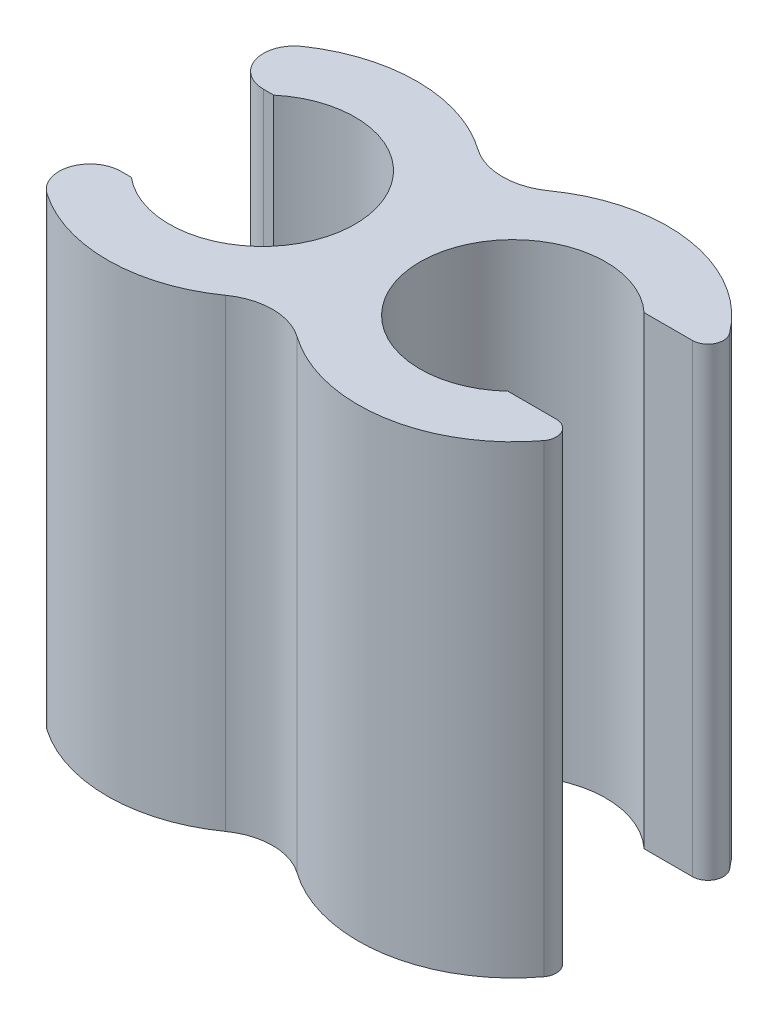
ISO-10303-21;
HEADER;
FILE_DESCRIPTION(('STEP AP214'),'2;1');
FILE_NAME('part.step','',(''),(''),'','','');
FILE_SCHEMA(('AUTOMOTIVE_DESIGN { 1 0 10303 214 1 1 1 1 }'));
ENDSEC;
DATA;
#1=APPLICATION_CONTEXT('core data for automotive mechanical design processes');
#2=APPLICATION_PROTOCOL_DEFINITION('international standard','automotive_design',2000,#1);
#3=PRODUCT_CONTEXT('',#1,'mechanical');
#4=PRODUCT('Part','Part','',(#3));
#5=PRODUCT_RELATED_PRODUCT_CATEGORY('part','',(#4));
#6=PRODUCT_DEFINITION_FORMATION('','',#4);
#7=PRODUCT_DEFINITION_CONTEXT('part definition',#1,'design');
#8=PRODUCT_DEFINITION('design','',#6,#7);
#9=PRODUCT_DEFINITION_SHAPE('','',#8);
#10=(LENGTH_UNIT() NAMED_UNIT(*) SI_UNIT(.MILLI.,.METRE.));
#11=(NAMED_UNIT(*) PLANE_ANGLE_UNIT() SI_UNIT($,.RADIAN.));
#12=(NAMED_UNIT(*) SI_UNIT($,.STERADIAN.) SOLID_ANGLE_UNIT());
#13=UNCERTAINTY_MEASURE_WITH_UNIT(LENGTH_MEASURE(1.E-05),#10,'distance_accuracy_value','');
#14=(GEOMETRIC_REPRESENTATION_CONTEXT(3) GLOBAL_UNCERTAINTY_ASSIGNED_CONTEXT((#13)) GLOBAL_UNIT_ASSIGNED_CONTEXT((#10,
#11,#12)) REPRESENTATION_CONTEXT('',''));
#15=CARTESIAN_POINT('',(0.,0.,0.));
#16=DIRECTION('',(0.,0.,1.));
#17=DIRECTION('',(1.,0.,0.));
#18=AXIS2_PLACEMENT_3D('',#15,#16,#17);
#19=CARTESIAN_POINT('',(8.10004414496258,0.,0.00233525388321351));
#20=DIRECTION('',(0.,1.,0.));
#21=DIRECTION('',(0.,0.,1.));
#22=AXIS2_PLACEMENT_3D('',#19,#20,#21);
#23=CYLINDRICAL_SURFACE('',#22,5.);
#24=CARTESIAN_POINT('',(8.10004414496258,15.,0.00233525388321351));
#25=DIRECTION('',(0.,1.,0.));
#26=DIRECTION('',(0.,0.,1.));
#27=AXIS2_PLACEMENT_3D('',#24,#25,#26);
#28=CIRCLE('',#27,5.);
#29=CARTESIAN_POINT('',(12.1000441449626,15.,-2.99766474611679));
#30=VERTEX_POINT('',#29);
#31=CARTESIAN_POINT('',(5.20834697149032,15.,-4.07664592490795));
#32=VERTEX_POINT('',#31);
#33=EDGE_CURVE('E174',#30,#32,#28,.T.);
#34=ORIENTED_EDGE('',*,*,#33,.F.);
#35=DIRECTION('',(0.,1.,0.));
#36=VECTOR('',#35,1.);
#37=CARTESIAN_POINT('',(12.1000441449626,0.,-2.99766474611679));
#38=LINE('',#37,#36);
#39=CARTESIAN_POINT('',(12.1000441449626,0.,-2.99766474611679));
#40=VERTEX_POINT('',#39);
#41=EDGE_CURVE('E11',#30,#40,#38,.F.);
#42=ORIENTED_EDGE('',*,*,#41,.T.);
#43=CARTESIAN_POINT('',(8.10004414496258,0.,0.00233525388321351));
#44=DIRECTION('',(0.,1.,0.));
#45=DIRECTION('',(0.,0.,1.));
#46=AXIS2_PLACEMENT_3D('',#43,#44,#45);
#47=CIRCLE('',#46,5.);
#48=CARTESIAN_POINT('',(5.20834697149032,0.,-4.07664592490795));
#49=VERTEX_POINT('',#48);
#50=EDGE_CURVE('E185',#40,#49,#47,.T.);
#51=ORIENTED_EDGE('',*,*,#50,.T.);
#52=DIRECTION('',(0.,1.,0.));
#53=VECTOR('',#52,1.);
#54=CARTESIAN_POINT('',(5.20834697149032,0.,-4.07664592490795));
#55=LINE('',#54,#53);
#56=EDGE_CURVE('E209',#49,#32,#55,.T.);
#57=ORIENTED_EDGE('',*,*,#56,.T.);
#58=EDGE_LOOP('',(#34,#42,#51,#57));
#59=FACE_BOUND('',#58,.T.);
#60=ADVANCED_FACE('F33',(#59),#23,.T.);
#61=CARTESIAN_POINT('',(0.,15.,0.));
#62=DIRECTION('',(0.,-1.,0.));
#63=DIRECTION('',(0.,0.,-1.));
#64=AXIS2_PLACEMENT_3D('',#61,#62,#63);
#65=CYLINDRICAL_SURFACE('',#64,5.);
#66=CARTESIAN_POINT('',(0.,15.,0.));
#67=DIRECTION('',(0.,1.,0.));
#68=DIRECTION('',(0.,0.,1.));
#69=AXIS2_PLACEMENT_3D('',#66,#67,#68);
#70=CIRCLE('',#69,5.);
#71=CARTESIAN_POINT('',(-2.82566363886433,15.,4.125));
#72=VERTEX_POINT('',#71);
#73=CARTESIAN_POINT('',(2.89169717347226,15.,4.07898117879116));
#74=VERTEX_POINT('',#73);
#75=EDGE_CURVE('E198',#72,#74,#70,.T.);
#76=ORIENTED_EDGE('',*,*,#75,.F.);
#77=DIRECTION('',(0.,-1.,0.));
#78=VECTOR('',#77,1.);
#79=CARTESIAN_POINT('',(-2.82566363886433,15.,4.125));
#80=LINE('',#79,#78);
#81=CARTESIAN_POINT('',(-2.82566363886433,0.,4.125));
#82=VERTEX_POINT('',#81);
#83=EDGE_CURVE('E227',#72,#82,#80,.T.);
#84=ORIENTED_EDGE('',*,*,#83,.T.);
#85=CARTESIAN_POINT('',(0.,0.,0.));
#86=DIRECTION('',(0.,1.,0.));
#87=DIRECTION('',(0.,0.,1.));
#88=AXIS2_PLACEMENT_3D('',#85,#86,#87);
#89=CIRCLE('',#88,5.);
#90=CARTESIAN_POINT('',(2.89169717347226,0.,4.07898117879116));
#91=VERTEX_POINT('',#90);
#92=EDGE_CURVE('E191',#82,#91,#89,.T.);
#93=ORIENTED_EDGE('',*,*,#92,.T.);
#94=DIRECTION('',(0.,-1.,0.));
#95=VECTOR('',#94,1.);
#96=CARTESIAN_POINT('',(2.89169717347226,15.,4.07898117879116));
#97=LINE('',#96,#95);
#98=EDGE_CURVE('E197',#91,#74,#97,.F.);
#99=ORIENTED_EDGE('',*,*,#98,.T.);
#100=EDGE_LOOP('',(#76,#84,#93,#99));
#101=FACE_BOUND('',#100,.T.);
#102=ADVANCED_FACE('F282',(#101),#65,.T.);
#103=CARTESIAN_POINT('',(0.,15.,0.));
#104=DIRECTION('',(0.,1.,0.));
#105=DIRECTION('',(0.,0.,1.));
#106=AXIS2_PLACEMENT_3D('',#103,#104,#105);
#107=PLANE('',#106);
#108=CARTESIAN_POINT('',(5.20599550060443,15.,4.07964839418636));
#109=VERTEX_POINT('',#108);
#110=CARTESIAN_POINT('',(12.1000441449626,15.,3.00233525388321));
#111=VERTEX_POINT('',#110);
#112=EDGE_CURVE('E186',#109,#111,#28,.T.);
#113=ORIENTED_EDGE('',*,*,#112,.T.);
#114=CARTESIAN_POINT('',(11.7000441449626,15.,2.70233525388321));
#115=DIRECTION('',(0.,1.,0.));
#116=DIRECTION('',(0.,0.,1.));
#117=AXIS2_PLACEMENT_3D('',#114,#115,#116);
#118=CIRCLE('',#117,0.5);
#119=CARTESIAN_POINT('',(11.7000441449626,15.,2.20233525388321));
#120=VERTEX_POINT('',#119);
#121=EDGE_CURVE('E165',#111,#120,#118,.T.);
#122=ORIENTED_EDGE('',*,*,#121,.T.);
#123=DIRECTION('',(1.,0.,0.));
#124=VECTOR('',#123,1.);
#125=CARTESIAN_POINT('',(8.52364594933811,15.,2.20233525388321));
#126=LINE('',#125,#124);
#127=CARTESIAN_POINT('',(10.1396519503997,15.,2.20233525388321));
#128=VERTEX_POINT('',#127);
#129=EDGE_CURVE('E149',#128,#120,#126,.T.);
#130=ORIENTED_EDGE('',*,*,#129,.F.);
#131=CARTESIAN_POINT('',(8.10004414496258,15.,0.00233525388321351));
#132=DIRECTION('',(0.,1.,0.));
#133=DIRECTION('',(0.,0.,1.));
#134=AXIS2_PLACEMENT_3D('',#131,#132,#133);
#135=CIRCLE('',#134,3.);
#136=CARTESIAN_POINT('',(10.1396519503997,15.,-2.19766474611679));
#137=VERTEX_POINT('',#136);
#138=EDGE_CURVE('E163',#137,#128,#135,.T.);
#139=ORIENTED_EDGE('',*,*,#138,.F.);
#140=DIRECTION('',(-1.,0.,0.));
#141=VECTOR('',#140,1.);
#142=CARTESIAN_POINT('',(8.52364594933811,15.,-2.19766474611679));
#143=LINE('',#142,#141);
#144=CARTESIAN_POINT('',(11.7000441449626,15.,-2.19766474611679));
#145=VERTEX_POINT('',#144);
#146=EDGE_CURVE('E166',#145,#137,#143,.T.);
#147=ORIENTED_EDGE('',*,*,#146,.F.);
#148=CARTESIAN_POINT('',(11.7000441449626,15.,-2.69766474611679));
#149=DIRECTION('',(0.,1.,0.));
#150=DIRECTION('',(0.,0.,1.));
#151=AXIS2_PLACEMENT_3D('',#148,#149,#150);
#152=CIRCLE('',#151,0.5);
#153=EDGE_CURVE('E48',#145,#30,#152,.T.);
#154=ORIENTED_EDGE('',*,*,#153,.T.);
#155=ORIENTED_EDGE('',*,*,#33,.T.);
#156=CARTESIAN_POINT('',(4.05166810210141,15.,-5.70823839642441));
#157=DIRECTION('',(0.,1.,0.));
#158=DIRECTION('',(0.,0.,1.));
#159=AXIS2_PLACEMENT_3D('',#156,#157,#158);
#160=CIRCLE('',#159,2.);
#161=CARTESIAN_POINT('',(2.89404864435815,15.,-4.07731314030315));
#162=VERTEX_POINT('',#161);
#163=EDGE_CURVE('E215',#32,#162,#160,.F.);
#164=ORIENTED_EDGE('',*,*,#163,.T.);
#165=CARTESIAN_POINT('',(-2.82566363886433,15.,-4.125));
#166=VERTEX_POINT('',#165);
#167=EDGE_CURVE('E194',#162,#166,#70,.T.);
#168=ORIENTED_EDGE('',*,*,#167,.T.);
#169=CARTESIAN_POINT('',(-2.26053091109146,15.,-3.3));
#170=DIRECTION('',(0.,1.,0.));
#171=DIRECTION('',(0.,0.,1.));
#172=AXIS2_PLACEMENT_3D('',#169,#170,#171);
#173=CIRCLE('',#172,1.);
#174=CARTESIAN_POINT('',(-2.26053091109146,15.,-2.3));
#175=VERTEX_POINT('',#174);
#176=EDGE_CURVE('E236',#166,#175,#173,.T.);
#177=ORIENTED_EDGE('',*,*,#176,.T.);
#178=DIRECTION('',(1.,0.,0.));
#179=VECTOR('',#178,1.);
#180=CARTESIAN_POINT('',(-7.30921560038474,15.,-2.3));
#181=LINE('',#180,#179);
#182=CARTESIAN_POINT('',(-1.92613602842582,15.,-2.3));
#183=VERTEX_POINT('',#182);
#184=EDGE_CURVE('E177',#175,#183,#181,.T.);
#185=ORIENTED_EDGE('',*,*,#184,.T.);
#186=CARTESIAN_POINT('',(0.,15.,0.));
#187=DIRECTION('',(0.,1.,0.));
#188=DIRECTION('',(0.,0.,1.));
#189=AXIS2_PLACEMENT_3D('',#186,#187,#188);
#190=CIRCLE('',#189,3.);
#191=CARTESIAN_POINT('',(-1.92613602842582,15.,2.3));
#192=VERTEX_POINT('',#191);
#193=EDGE_CURVE('E188',#192,#183,#190,.T.);
#194=ORIENTED_EDGE('',*,*,#193,.F.);
#195=DIRECTION('',(-1.,0.,0.));
#196=VECTOR('',#195,1.);
#197=CARTESIAN_POINT('',(-7.30921560038474,15.,2.3));
#198=LINE('',#197,#196);
#199=CARTESIAN_POINT('',(-2.26053091109146,15.,2.3));
#200=VERTEX_POINT('',#199);
#201=EDGE_CURVE('E172',#192,#200,#198,.T.);
#202=ORIENTED_EDGE('',*,*,#201,.T.);
#203=CARTESIAN_POINT('',(-2.26053091109146,15.,3.3));
#204=DIRECTION('',(0.,1.,0.));
#205=DIRECTION('',(0.,0.,1.));
#206=AXIS2_PLACEMENT_3D('',#203,#204,#205);
#207=CIRCLE('',#206,1.);
#208=EDGE_CURVE('E238',#200,#72,#207,.T.);
#209=ORIENTED_EDGE('',*,*,#208,.T.);
#210=ORIENTED_EDGE('',*,*,#75,.T.);
#211=CARTESIAN_POINT('',(4.04837604286117,15.,5.71057365030763));
#212=DIRECTION('',(0.,1.,0.));
#213=DIRECTION('',(0.,0.,1.));
#214=AXIS2_PLACEMENT_3D('',#211,#212,#213);
#215=CIRCLE('',#214,2.);
#216=EDGE_CURVE('E217',#74,#109,#215,.F.);
#217=ORIENTED_EDGE('',*,*,#216,.T.);
#218=EDGE_LOOP('',(#113,#122,#130,#139,#147,#154,#155,#164,#168,#177,#185,#194,#202,#209,#210,#217));
#219=FACE_BOUND('',#218,.T.);
#220=ADVANCED_FACE('F162',(#219),#107,.T.);
#221=CARTESIAN_POINT('',(0.,0.,0.));
#222=DIRECTION('',(0.,1.,0.));
#223=DIRECTION('',(0.,0.,1.));
#224=AXIS2_PLACEMENT_3D('',#221,#222,#223);
#225=PLANE('',#224);
#226=DIRECTION('',(1.,0.,0.));
#227=VECTOR('',#226,1.);
#228=CARTESIAN_POINT('',(8.52364594933811,0.,2.20233525388321));
#229=LINE('',#228,#227);
#230=CARTESIAN_POINT('',(10.1396519503997,0.,2.20233525388321));
#231=VERTEX_POINT('',#230);
#232=CARTESIAN_POINT('',(11.7000441449626,0.,2.20233525388321));
#233=VERTEX_POINT('',#232);
#234=EDGE_CURVE('E152',#231,#233,#229,.T.);
#235=ORIENTED_EDGE('',*,*,#234,.T.);
#236=CARTESIAN_POINT('',(11.7000441449626,0.,2.70233525388321));
#237=DIRECTION('',(0.,1.,0.));
#238=DIRECTION('',(0.,0.,1.));
#239=AXIS2_PLACEMENT_3D('',#236,#237,#238);
#240=CIRCLE('',#239,0.5);
#241=CARTESIAN_POINT('',(12.1000441449626,0.,3.00233525388321));
#242=VERTEX_POINT('',#241);
#243=EDGE_CURVE('E249',#233,#242,#240,.F.);
#244=ORIENTED_EDGE('',*,*,#243,.T.);
#245=CARTESIAN_POINT('',(5.20599550060443,0.,4.07964839418636));
#246=VERTEX_POINT('',#245);
#247=EDGE_CURVE('E181',#246,#242,#47,.T.);
#248=ORIENTED_EDGE('',*,*,#247,.F.);
#249=CARTESIAN_POINT('',(4.04837604286117,0.,5.71057365030763));
#250=DIRECTION('',(0.,1.,0.));
#251=DIRECTION('',(0.,0.,1.));
#252=AXIS2_PLACEMENT_3D('',#249,#250,#251);
#253=CIRCLE('',#252,2.);
#254=EDGE_CURVE('E219',#246,#91,#253,.T.);
#255=ORIENTED_EDGE('',*,*,#254,.T.);
#256=ORIENTED_EDGE('',*,*,#92,.F.);
#257=CARTESIAN_POINT('',(-2.26053091109146,0.,3.3));
#258=DIRECTION('',(0.,1.,0.));
#259=DIRECTION('',(0.,0.,1.));
#260=AXIS2_PLACEMENT_3D('',#257,#258,#259);
#261=CIRCLE('',#260,1.);
#262=CARTESIAN_POINT('',(-2.26053091109146,0.,2.3));
#263=VERTEX_POINT('',#262);
#264=EDGE_CURVE('E232',#82,#263,#261,.F.);
#265=ORIENTED_EDGE('',*,*,#264,.T.);
#266=DIRECTION('',(-1.,0.,0.));
#267=VECTOR('',#266,1.);
#268=CARTESIAN_POINT('',(-7.30921560038474,0.,2.3));
#269=LINE('',#268,#267);
#270=CARTESIAN_POINT('',(-1.92613602842582,0.,2.3));
#271=VERTEX_POINT('',#270);
#272=EDGE_CURVE('E263',#271,#263,#269,.T.);
#273=ORIENTED_EDGE('',*,*,#272,.F.);
#274=CARTESIAN_POINT('',(0.,0.,0.));
#275=DIRECTION('',(0.,1.,0.));
#276=DIRECTION('',(0.,0.,1.));
#277=AXIS2_PLACEMENT_3D('',#274,#275,#276);
#278=CIRCLE('',#277,3.);
#279=CARTESIAN_POINT('',(-1.92613602842582,0.,-2.3));
#280=VERTEX_POINT('',#279);
#281=EDGE_CURVE('E184',#271,#280,#278,.T.);
#282=ORIENTED_EDGE('',*,*,#281,.T.);
#283=DIRECTION('',(1.,0.,0.));
#284=VECTOR('',#283,1.);
#285=CARTESIAN_POINT('',(-7.30921560038474,0.,-2.3));
#286=LINE('',#285,#284);
#287=CARTESIAN_POINT('',(-2.26053091109146,0.,-2.3));
#288=VERTEX_POINT('',#287);
#289=EDGE_CURVE('E265',#288,#280,#286,.T.);
#290=ORIENTED_EDGE('',*,*,#289,.F.);
#291=CARTESIAN_POINT('',(-2.26053091109146,0.,-3.3));
#292=DIRECTION('',(0.,1.,0.));
#293=DIRECTION('',(0.,0.,1.));
#294=AXIS2_PLACEMENT_3D('',#291,#292,#293);
#295=CIRCLE('',#294,1.);
#296=CARTESIAN_POINT('',(-2.82566363886433,0.,-4.125));
#297=VERTEX_POINT('',#296);
#298=EDGE_CURVE('E230',#288,#297,#295,.F.);
#299=ORIENTED_EDGE('',*,*,#298,.T.);
#300=CARTESIAN_POINT('',(2.89404864435815,0.,-4.07731314030315));
#301=VERTEX_POINT('',#300);
#302=EDGE_CURVE('E199',#301,#297,#89,.T.);
#303=ORIENTED_EDGE('',*,*,#302,.F.);
#304=CARTESIAN_POINT('',(4.05166810210141,0.,-5.70823839642441));
#305=DIRECTION('',(0.,1.,0.));
#306=DIRECTION('',(0.,0.,1.));
#307=AXIS2_PLACEMENT_3D('',#304,#305,#306);
#308=CIRCLE('',#307,2.);
#309=EDGE_CURVE('E212',#301,#49,#308,.T.);
#310=ORIENTED_EDGE('',*,*,#309,.T.);
#311=ORIENTED_EDGE('',*,*,#50,.F.);
#312=CARTESIAN_POINT('',(11.7000441449626,0.,-2.69766474611679));
#313=DIRECTION('',(0.,1.,0.));
#314=DIRECTION('',(0.,0.,1.));
#315=AXIS2_PLACEMENT_3D('',#312,#313,#314);
#316=CIRCLE('',#315,0.5);
#317=CARTESIAN_POINT('',(11.7000441449626,0.,-2.19766474611679));
#318=VERTEX_POINT('',#317);
#319=EDGE_CURVE('E247',#40,#318,#316,.F.);
#320=ORIENTED_EDGE('',*,*,#319,.T.);
#321=DIRECTION('',(-1.,0.,0.));
#322=VECTOR('',#321,1.);
#323=CARTESIAN_POINT('',(8.52364594933811,0.,-2.19766474611679));
#324=LINE('',#323,#322);
#325=CARTESIAN_POINT('',(10.1396519503997,0.,-2.19766474611679));
#326=VERTEX_POINT('',#325);
#327=EDGE_CURVE('E257',#318,#326,#324,.T.);
#328=ORIENTED_EDGE('',*,*,#327,.T.);
#329=CARTESIAN_POINT('',(8.10004414496258,0.,0.00233525388321351));
#330=DIRECTION('',(0.,1.,0.));
#331=DIRECTION('',(0.,0.,1.));
#332=AXIS2_PLACEMENT_3D('',#329,#330,#331);
#333=CIRCLE('',#332,3.);
#334=EDGE_CURVE('E171',#326,#231,#333,.T.);
#335=ORIENTED_EDGE('',*,*,#334,.T.);
#336=EDGE_LOOP('',(#235,#244,#248,#255,#256,#265,#273,#282,#290,#299,#303,#310,#311,#320,#328,#335));
#337=FACE_BOUND('',#336,.T.);
#338=ADVANCED_FACE('F296',(#337),#225,.F.);
#339=ORIENTED_EDGE('',*,*,#302,.T.);
#340=DIRECTION('',(0.,-1.,0.));
#341=VECTOR('',#340,1.);
#342=CARTESIAN_POINT('',(-2.82566363886433,15.,-4.125));
#343=LINE('',#342,#341);
#344=EDGE_CURVE('E240',#297,#166,#343,.F.);
#345=ORIENTED_EDGE('',*,*,#344,.T.);
#346=ORIENTED_EDGE('',*,*,#167,.F.);
#347=DIRECTION('',(0.,-1.,0.));
#348=VECTOR('',#347,1.);
#349=CARTESIAN_POINT('',(2.89404864435815,15.,-4.07731314030315));
#350=LINE('',#349,#348);
#351=EDGE_CURVE('E204',#162,#301,#350,.T.);
#352=ORIENTED_EDGE('',*,*,#351,.T.);
#353=EDGE_LOOP('',(#339,#345,#346,#352));
#354=FACE_BOUND('',#353,.T.);
#355=ADVANCED_FACE('F305',(#354),#65,.T.);
#356=CARTESIAN_POINT('',(0.,15.,0.));
#357=DIRECTION('',(0.,-1.,0.));
#358=DIRECTION('',(0.,0.,-1.));
#359=AXIS2_PLACEMENT_3D('',#356,#357,#358);
#360=CYLINDRICAL_SURFACE('',#359,3.);
#361=DIRECTION('',(0.,-1.,0.));
#362=VECTOR('',#361,1.);
#363=CARTESIAN_POINT('',(-1.92613602842582,15.,2.3));
#364=LINE('',#363,#362);
#365=EDGE_CURVE('E225',#192,#271,#364,.T.);
#366=ORIENTED_EDGE('',*,*,#365,.F.);
#367=ORIENTED_EDGE('',*,*,#193,.T.);
#368=DIRECTION('',(0.,-1.,0.));
#369=VECTOR('',#368,1.);
#370=CARTESIAN_POINT('',(-1.92613602842582,15.,-2.3));
#371=LINE('',#370,#369);
#372=EDGE_CURVE('E222',#280,#183,#371,.F.);
#373=ORIENTED_EDGE('',*,*,#372,.F.);
#374=ORIENTED_EDGE('',*,*,#281,.F.);
#375=EDGE_LOOP('',(#366,#367,#373,#374));
#376=FACE_BOUND('',#375,.T.);
#377=ADVANCED_FACE('F319',(#376),#360,.F.);
#378=ORIENTED_EDGE('',*,*,#247,.T.);
#379=DIRECTION('',(0.,1.,0.));
#380=VECTOR('',#379,1.);
#381=CARTESIAN_POINT('',(12.1000441449626,0.,3.00233525388321));
#382=LINE('',#381,#380);
#383=EDGE_CURVE('E251',#242,#111,#382,.T.);
#384=ORIENTED_EDGE('',*,*,#383,.T.);
#385=ORIENTED_EDGE('',*,*,#112,.F.);
#386=DIRECTION('',(0.,1.,0.));
#387=VECTOR('',#386,1.);
#388=CARTESIAN_POINT('',(5.20599550060443,0.,4.07964839418636));
#389=LINE('',#388,#387);
#390=EDGE_CURVE('E207',#109,#246,#389,.F.);
#391=ORIENTED_EDGE('',*,*,#390,.T.);
#392=EDGE_LOOP('',(#378,#384,#385,#391));
#393=FACE_BOUND('',#392,.T.);
#394=ADVANCED_FACE('F291',(#393),#23,.T.);
#395=CARTESIAN_POINT('',(8.10004414496258,0.,0.00233525388321351));
#396=DIRECTION('',(0.,1.,0.));
#397=DIRECTION('',(0.,0.,1.));
#398=AXIS2_PLACEMENT_3D('',#395,#396,#397);
#399=CYLINDRICAL_SURFACE('',#398,3.);
#400=ORIENTED_EDGE('',*,*,#334,.F.);
#401=DIRECTION('',(0.,1.,0.));
#402=VECTOR('',#401,1.);
#403=CARTESIAN_POINT('',(10.1396519503997,0.,-2.19766474611679));
#404=LINE('',#403,#402);
#405=EDGE_CURVE('E157',#326,#137,#404,.T.);
#406=ORIENTED_EDGE('',*,*,#405,.T.);
#407=ORIENTED_EDGE('',*,*,#138,.T.);
#408=DIRECTION('',(0.,1.,0.));
#409=VECTOR('',#408,1.);
#410=CARTESIAN_POINT('',(10.1396519503997,0.,2.20233525388321));
#411=LINE('',#410,#409);
#412=EDGE_CURVE('E145',#128,#231,#411,.F.);
#413=ORIENTED_EDGE('',*,*,#412,.T.);
#414=EDGE_LOOP('',(#400,#406,#407,#413));
#415=FACE_BOUND('',#414,.T.);
#416=ADVANCED_FACE('F169',(#415),#399,.F.);
#417=CARTESIAN_POINT('',(4.05166810210141,0.,-5.70823839642441));
#418=DIRECTION('',(0.,1.,0.));
#419=DIRECTION('',(0.,0.,1.));
#420=AXIS2_PLACEMENT_3D('',#417,#418,#419);
#421=CYLINDRICAL_SURFACE('',#420,2.);
#422=ORIENTED_EDGE('',*,*,#163,.F.);
#423=ORIENTED_EDGE('',*,*,#56,.F.);
#424=ORIENTED_EDGE('',*,*,#309,.F.);
#425=ORIENTED_EDGE('',*,*,#351,.F.);
#426=EDGE_LOOP('',(#422,#423,#424,#425));
#427=FACE_BOUND('',#426,.T.);
#428=ADVANCED_FACE('F308',(#427),#421,.F.);
#429=CARTESIAN_POINT('',(4.04837604286117,0.,5.71057365030763));
#430=DIRECTION('',(0.,-1.,0.));
#431=DIRECTION('',(0.,0.,-1.));
#432=AXIS2_PLACEMENT_3D('',#429,#430,#431);
#433=CYLINDRICAL_SURFACE('',#432,2.);
#434=ORIENTED_EDGE('',*,*,#254,.F.);
#435=ORIENTED_EDGE('',*,*,#390,.F.);
#436=ORIENTED_EDGE('',*,*,#216,.F.);
#437=ORIENTED_EDGE('',*,*,#98,.F.);
#438=EDGE_LOOP('',(#434,#435,#436,#437));
#439=FACE_BOUND('',#438,.T.);
#440=ADVANCED_FACE('F287',(#439),#433,.F.);
#441=CARTESIAN_POINT('',(-7.30921560038474,15.,-2.3));
#442=DIRECTION('',(0.,0.,-1.));
#443=DIRECTION('',(-1.,0.,0.));
#444=AXIS2_PLACEMENT_3D('',#441,#442,#443);
#445=PLANE('',#444);
#446=ORIENTED_EDGE('',*,*,#184,.F.);
#447=DIRECTION('',(0.,-1.,0.));
#448=VECTOR('',#447,1.);
#449=CARTESIAN_POINT('',(-2.26053091109146,15.,-2.3));
#450=LINE('',#449,#448);
#451=EDGE_CURVE('E158',#175,#288,#450,.T.);
#452=ORIENTED_EDGE('',*,*,#451,.T.);
#453=ORIENTED_EDGE('',*,*,#289,.T.);
#454=ORIENTED_EDGE('',*,*,#372,.T.);
#455=EDGE_LOOP('',(#446,#452,#453,#454));
#456=FACE_BOUND('',#455,.T.);
#457=ADVANCED_FACE('F316',(#456),#445,.F.);
#458=CARTESIAN_POINT('',(-7.30921560038474,15.,2.3));
#459=DIRECTION('',(0.,0.,1.));
#460=DIRECTION('',(1.,0.,0.));
#461=AXIS2_PLACEMENT_3D('',#458,#459,#460);
#462=PLANE('',#461);
#463=ORIENTED_EDGE('',*,*,#272,.T.);
#464=DIRECTION('',(0.,-1.,0.));
#465=VECTOR('',#464,1.);
#466=CARTESIAN_POINT('',(-2.26053091109146,15.,2.3));
#467=LINE('',#466,#465);
#468=EDGE_CURVE('E234',#263,#200,#467,.F.);
#469=ORIENTED_EDGE('',*,*,#468,.T.);
#470=ORIENTED_EDGE('',*,*,#201,.F.);
#471=ORIENTED_EDGE('',*,*,#365,.T.);
#472=EDGE_LOOP('',(#463,#469,#470,#471));
#473=FACE_BOUND('',#472,.T.);
#474=ADVANCED_FACE('F270',(#473),#462,.F.);
#475=CARTESIAN_POINT('',(-2.26053091109146,15.,3.3));
#476=DIRECTION('',(0.,-1.,0.));
#477=DIRECTION('',(0.,0.,-1.));
#478=AXIS2_PLACEMENT_3D('',#475,#476,#477);
#479=CYLINDRICAL_SURFACE('',#478,1.);
#480=ORIENTED_EDGE('',*,*,#208,.F.);
#481=ORIENTED_EDGE('',*,*,#468,.F.);
#482=ORIENTED_EDGE('',*,*,#264,.F.);
#483=ORIENTED_EDGE('',*,*,#83,.F.);
#484=EDGE_LOOP('',(#480,#481,#482,#483));
#485=FACE_BOUND('',#484,.T.);
#486=ADVANCED_FACE('F276',(#485),#479,.T.);
#487=CARTESIAN_POINT('',(-2.26053091109146,15.,-3.3));
#488=DIRECTION('',(0.,-1.,0.));
#489=DIRECTION('',(0.,0.,-1.));
#490=AXIS2_PLACEMENT_3D('',#487,#488,#489);
#491=CYLINDRICAL_SURFACE('',#490,1.);
#492=ORIENTED_EDGE('',*,*,#298,.F.);
#493=ORIENTED_EDGE('',*,*,#451,.F.);
#494=ORIENTED_EDGE('',*,*,#176,.F.);
#495=ORIENTED_EDGE('',*,*,#344,.F.);
#496=EDGE_LOOP('',(#492,#493,#494,#495));
#497=FACE_BOUND('',#496,.T.);
#498=ADVANCED_FACE('F312',(#497),#491,.T.);
#499=CARTESIAN_POINT('',(8.52364594933811,0.,2.20233525388321));
#500=DIRECTION('',(0.,0.,1.));
#501=DIRECTION('',(1.,0.,0.));
#502=AXIS2_PLACEMENT_3D('',#499,#500,#501);
#503=PLANE('',#502);
#504=ORIENTED_EDGE('',*,*,#129,.T.);
#505=DIRECTION('',(0.,-1.,0.));
#506=VECTOR('',#505,1.);
#507=CARTESIAN_POINT('',(11.7000441449626,0.,2.20233525388321));
#508=LINE('',#507,#506);
#509=EDGE_CURVE('E245',#120,#233,#508,.T.);
#510=ORIENTED_EDGE('',*,*,#509,.T.);
#511=ORIENTED_EDGE('',*,*,#234,.F.);
#512=ORIENTED_EDGE('',*,*,#412,.F.);
#513=EDGE_LOOP('',(#504,#510,#511,#512));
#514=FACE_BOUND('',#513,.T.);
#515=ADVANCED_FACE('F147',(#514),#503,.F.);
#516=CARTESIAN_POINT('',(8.52364594933811,0.,-2.19766474611679));
#517=DIRECTION('',(0.,0.,-1.));
#518=DIRECTION('',(-1.,0.,0.));
#519=AXIS2_PLACEMENT_3D('',#516,#517,#518);
#520=PLANE('',#519);
#521=ORIENTED_EDGE('',*,*,#327,.F.);
#522=DIRECTION('',(0.,-1.,0.));
#523=VECTOR('',#522,1.);
#524=CARTESIAN_POINT('',(11.7000441449626,15.,-2.19766474611679));
#525=LINE('',#524,#523);
#526=EDGE_CURVE('E41',#318,#145,#525,.F.);
#527=ORIENTED_EDGE('',*,*,#526,.T.);
#528=ORIENTED_EDGE('',*,*,#146,.T.);
#529=ORIENTED_EDGE('',*,*,#405,.F.);
#530=EDGE_LOOP('',(#521,#527,#528,#529));
#531=FACE_BOUND('',#530,.T.);
#532=ADVANCED_FACE('F256',(#531),#520,.F.);
#533=CARTESIAN_POINT('',(11.7000441449626,0.,2.70233525388321));
#534=DIRECTION('',(0.,1.,0.));
#535=DIRECTION('',(0.,0.,1.));
#536=AXIS2_PLACEMENT_3D('',#533,#534,#535);
#537=CYLINDRICAL_SURFACE('',#536,0.5);
#538=ORIENTED_EDGE('',*,*,#121,.F.);
#539=ORIENTED_EDGE('',*,*,#383,.F.);
#540=ORIENTED_EDGE('',*,*,#243,.F.);
#541=ORIENTED_EDGE('',*,*,#509,.F.);
#542=EDGE_LOOP('',(#538,#539,#540,#541));
#543=FACE_BOUND('',#542,.T.);
#544=ADVANCED_FACE('F295',(#543),#537,.T.);
#545=CARTESIAN_POINT('',(11.7000441449626,0.,-2.69766474611679));
#546=DIRECTION('',(0.,1.,0.));
#547=DIRECTION('',(0.,0.,1.));
#548=AXIS2_PLACEMENT_3D('',#545,#546,#547);
#549=CYLINDRICAL_SURFACE('',#548,0.5);
#550=ORIENTED_EDGE('',*,*,#319,.F.);
#551=ORIENTED_EDGE('',*,*,#41,.F.);
#552=ORIENTED_EDGE('',*,*,#153,.F.);
#553=ORIENTED_EDGE('',*,*,#526,.F.);
#554=EDGE_LOOP('',(#550,#551,#552,#553));
#555=FACE_BOUND('',#554,.T.);
#556=ADVANCED_FACE('F35',(#555),#549,.T.);
#557=CLOSED_SHELL('',(#60,#102,#220,#338,#355,#377,#394,#416,#428,#440,#457,#474,#486,#498,#515,
#532,#544,#556));
#558=MANIFOLD_SOLID_BREP('B2',#557);
#559=ADVANCED_BREP_SHAPE_REPRESENTATION('',(#18,#558),#14);
#560=SHAPE_DEFINITION_REPRESENTATION(#9,#559);
ENDSEC;
END-ISO-10303-21;
